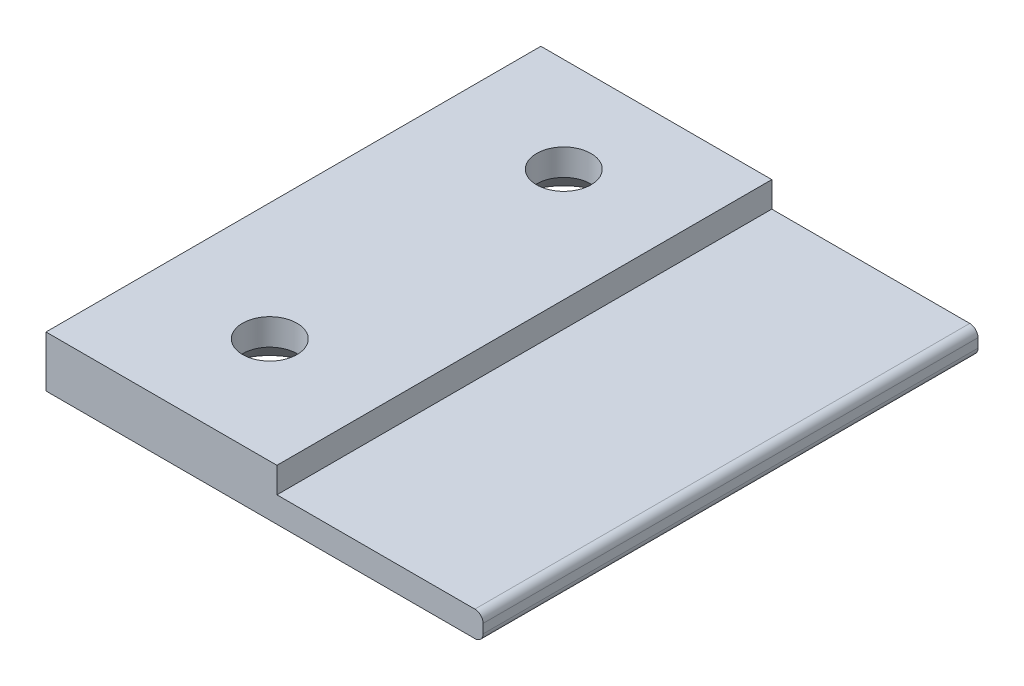
ISO-10303-21;
HEADER;
FILE_DESCRIPTION(('STEP AP214'),'2;1');
FILE_NAME('part.step','',(''),(''),'','','');
FILE_SCHEMA(('AUTOMOTIVE_DESIGN { 1 0 10303 214 1 1 1 1 }'));
ENDSEC;
DATA;
#1=APPLICATION_CONTEXT('core data for automotive mechanical design processes');
#2=APPLICATION_PROTOCOL_DEFINITION('international standard','automotive_design',2000,#1);
#3=PRODUCT_CONTEXT('',#1,'mechanical');
#4=PRODUCT('Part','Part','',(#3));
#5=PRODUCT_RELATED_PRODUCT_CATEGORY('part','',(#4));
#6=PRODUCT_DEFINITION_FORMATION('','',#4);
#7=PRODUCT_DEFINITION_CONTEXT('part definition',#1,'design');
#8=PRODUCT_DEFINITION('design','',#6,#7);
#9=PRODUCT_DEFINITION_SHAPE('','',#8);
#10=(LENGTH_UNIT() NAMED_UNIT(*) SI_UNIT(.MILLI.,.METRE.));
#11=(NAMED_UNIT(*) PLANE_ANGLE_UNIT() SI_UNIT($,.RADIAN.));
#12=(NAMED_UNIT(*) SI_UNIT($,.STERADIAN.) SOLID_ANGLE_UNIT());
#13=UNCERTAINTY_MEASURE_WITH_UNIT(LENGTH_MEASURE(1.E-05),#10,'distance_accuracy_value','');
#14=(GEOMETRIC_REPRESENTATION_CONTEXT(3) GLOBAL_UNCERTAINTY_ASSIGNED_CONTEXT((#13)) GLOBAL_UNIT_ASSIGNED_CONTEXT((#10,
#11,#12)) REPRESENTATION_CONTEXT('',''));
#15=CARTESIAN_POINT('',(0.,0.,0.));
#16=DIRECTION('',(0.,0.,1.));
#17=DIRECTION('',(1.,0.,0.));
#18=AXIS2_PLACEMENT_3D('',#15,#16,#17);
#19=CARTESIAN_POINT('',(0.,-6.2,60.));
#20=DIRECTION('',(1.,0.,0.));
#21=DIRECTION('',(0.,0.,-1.));
#22=AXIS2_PLACEMENT_3D('',#19,#20,#21);
#23=PLANE('',#22);
#24=DIRECTION('',(0.,-1.,0.));
#25=VECTOR('',#24,1.);
#26=CARTESIAN_POINT('',(0.,-6.2,0.));
#27=LINE('',#26,#25);
#28=CARTESIAN_POINT('',(0.,0.,0.));
#29=VERTEX_POINT('',#28);
#30=CARTESIAN_POINT('',(0.,-6.2,0.));
#31=VERTEX_POINT('',#30);
#32=EDGE_CURVE('E129',#29,#31,#27,.T.);
#33=ORIENTED_EDGE('',*,*,#32,.T.);
#34=DIRECTION('',(0.,0.,-1.));
#35=VECTOR('',#34,1.);
#36=CARTESIAN_POINT('',(0.,-6.2,60.));
#37=LINE('',#36,#35);
#38=CARTESIAN_POINT('',(0.,-6.2,60.));
#39=VERTEX_POINT('',#38);
#40=EDGE_CURVE('E110',#39,#31,#37,.T.);
#41=ORIENTED_EDGE('',*,*,#40,.F.);
#42=DIRECTION('',(0.,-1.,0.));
#43=VECTOR('',#42,1.);
#44=CARTESIAN_POINT('',(0.,-6.2,60.));
#45=LINE('',#44,#43);
#46=CARTESIAN_POINT('',(0.,0.,60.));
#47=VERTEX_POINT('',#46);
#48=EDGE_CURVE('E116',#47,#39,#45,.T.);
#49=ORIENTED_EDGE('',*,*,#48,.F.);
#50=DIRECTION('',(0.,0.,-1.));
#51=VECTOR('',#50,1.);
#52=CARTESIAN_POINT('',(0.,0.,60.));
#53=LINE('',#52,#51);
#54=EDGE_CURVE('E188',#47,#29,#53,.T.);
#55=ORIENTED_EDGE('',*,*,#54,.T.);
#56=EDGE_LOOP('',(#33,#41,#49,#55));
#57=FACE_BOUND('',#56,.T.);
#58=ADVANCED_FACE('F39',(#57),#23,.F.);
#59=CARTESIAN_POINT('',(53.,-6.2,60.));
#60=DIRECTION('',(0.,1.,0.));
#61=DIRECTION('',(0.,0.,1.));
#62=AXIS2_PLACEMENT_3D('',#59,#60,#61);
#63=PLANE('',#62);
#64=CARTESIAN_POINT('',(14.293755615536,-6.2,11.5151442867863));
#65=DIRECTION('',(0.,-1.,0.));
#66=DIRECTION('',(0.,0.,-1.));
#67=AXIS2_PLACEMENT_3D('',#64,#65,#66);
#68=CIRCLE('',#67,6.3);
#69=CARTESIAN_POINT('',(14.293755615536,-6.2,5.21514428678633));
#70=VERTEX_POINT('',#69);
#71=EDGE_CURVE('E279',#70,#70,#68,.T.);
#72=ORIENTED_EDGE('',*,*,#71,.F.);
#73=EDGE_LOOP('',(#72));
#74=FACE_BOUND('',#73,.T.);
#75=CARTESIAN_POINT('',(14.293755615536,-6.2,47.1589377928567));
#76=DIRECTION('',(0.,-1.,0.));
#77=DIRECTION('',(0.,0.,-1.));
#78=AXIS2_PLACEMENT_3D('',#75,#76,#77);
#79=CIRCLE('',#78,6.3);
#80=CARTESIAN_POINT('',(14.293755615536,-6.2,40.8589377928567));
#81=VERTEX_POINT('',#80);
#82=EDGE_CURVE('E170',#81,#81,#79,.T.);
#83=ORIENTED_EDGE('',*,*,#82,.F.);
#84=EDGE_LOOP('',(#83));
#85=FACE_BOUND('',#84,.T.);
#86=DIRECTION('',(1.,0.,0.));
#87=VECTOR('',#86,1.);
#88=CARTESIAN_POINT('',(53.,-6.2,0.));
#89=LINE('',#88,#87);
#90=CARTESIAN_POINT('',(52.,-6.2,0.));
#91=VERTEX_POINT('',#90);
#92=EDGE_CURVE('E167',#31,#91,#89,.T.);
#93=ORIENTED_EDGE('',*,*,#92,.T.);
#94=DIRECTION('',(0.,0.,-1.));
#95=VECTOR('',#94,1.);
#96=CARTESIAN_POINT('',(52.,-6.2,60.));
#97=LINE('',#96,#95);
#98=CARTESIAN_POINT('',(52.,-6.2,60.));
#99=VERTEX_POINT('',#98);
#100=EDGE_CURVE('E11',#91,#99,#97,.F.);
#101=ORIENTED_EDGE('',*,*,#100,.T.);
#102=DIRECTION('',(1.,0.,0.));
#103=VECTOR('',#102,1.);
#104=CARTESIAN_POINT('',(53.,-6.2,60.));
#105=LINE('',#104,#103);
#106=EDGE_CURVE('E106',#39,#99,#105,.T.);
#107=ORIENTED_EDGE('',*,*,#106,.F.);
#108=ORIENTED_EDGE('',*,*,#40,.T.);
#109=EDGE_LOOP('',(#93,#101,#107,#108));
#110=FACE_BOUND('',#109,.T.);
#111=ADVANCED_FACE('F108',(#74,#85,#110),#63,.F.);
#112=CARTESIAN_POINT('',(53.,-3.1,60.));
#113=DIRECTION('',(-1.,0.,0.));
#114=DIRECTION('',(0.,0.,1.));
#115=AXIS2_PLACEMENT_3D('',#112,#113,#114);
#116=PLANE('',#115);
#117=DIRECTION('',(0.,1.,0.));
#118=VECTOR('',#117,1.);
#119=CARTESIAN_POINT('',(53.,-3.1,0.));
#120=LINE('',#119,#118);
#121=CARTESIAN_POINT('',(53.,-5.2,0.));
#122=VERTEX_POINT('',#121);
#123=CARTESIAN_POINT('',(53.,-4.1,0.));
#124=VERTEX_POINT('',#123);
#125=EDGE_CURVE('E192',#122,#124,#120,.T.);
#126=ORIENTED_EDGE('',*,*,#125,.T.);
#127=DIRECTION('',(0.,0.,-1.));
#128=VECTOR('',#127,1.);
#129=CARTESIAN_POINT('',(53.,-4.1,60.));
#130=LINE('',#129,#128);
#131=CARTESIAN_POINT('',(53.,-4.1,60.));
#132=VERTEX_POINT('',#131);
#133=EDGE_CURVE('E63',#124,#132,#130,.F.);
#134=ORIENTED_EDGE('',*,*,#133,.T.);
#135=DIRECTION('',(0.,1.,0.));
#136=VECTOR('',#135,1.);
#137=CARTESIAN_POINT('',(53.,-3.1,60.));
#138=LINE('',#137,#136);
#139=CARTESIAN_POINT('',(53.,-5.2,60.));
#140=VERTEX_POINT('',#139);
#141=EDGE_CURVE('E115',#140,#132,#138,.T.);
#142=ORIENTED_EDGE('',*,*,#141,.F.);
#143=DIRECTION('',(0.,0.,-1.));
#144=VECTOR('',#143,1.);
#145=CARTESIAN_POINT('',(53.,-5.2,60.));
#146=LINE('',#145,#144);
#147=EDGE_CURVE('E149',#140,#122,#146,.T.);
#148=ORIENTED_EDGE('',*,*,#147,.T.);
#149=EDGE_LOOP('',(#126,#134,#142,#148));
#150=FACE_BOUND('',#149,.T.);
#151=ADVANCED_FACE('F220',(#150),#116,.F.);
#152=CARTESIAN_POINT('',(28.,-3.1,60.));
#153=DIRECTION('',(0.,-1.,0.));
#154=DIRECTION('',(0.,0.,-1.));
#155=AXIS2_PLACEMENT_3D('',#152,#153,#154);
#156=PLANE('',#155);
#157=DIRECTION('',(-1.,0.,0.));
#158=VECTOR('',#157,1.);
#159=CARTESIAN_POINT('',(28.,-3.1,60.));
#160=LINE('',#159,#158);
#161=CARTESIAN_POINT('',(52.,-3.1,60.));
#162=VERTEX_POINT('',#161);
#163=CARTESIAN_POINT('',(28.,-3.1,60.));
#164=VERTEX_POINT('',#163);
#165=EDGE_CURVE('E181',#162,#164,#160,.T.);
#166=ORIENTED_EDGE('',*,*,#165,.F.);
#167=DIRECTION('',(0.,0.,-1.));
#168=VECTOR('',#167,1.);
#169=CARTESIAN_POINT('',(52.,-3.1,60.));
#170=LINE('',#169,#168);
#171=CARTESIAN_POINT('',(52.,-3.1,0.));
#172=VERTEX_POINT('',#171);
#173=EDGE_CURVE('E131',#162,#172,#170,.T.);
#174=ORIENTED_EDGE('',*,*,#173,.T.);
#175=DIRECTION('',(-1.,0.,0.));
#176=VECTOR('',#175,1.);
#177=CARTESIAN_POINT('',(28.,-3.1,0.));
#178=LINE('',#177,#176);
#179=CARTESIAN_POINT('',(28.,-3.1,0.));
#180=VERTEX_POINT('',#179);
#181=EDGE_CURVE('E195',#172,#180,#178,.T.);
#182=ORIENTED_EDGE('',*,*,#181,.T.);
#183=DIRECTION('',(0.,0.,-1.));
#184=VECTOR('',#183,1.);
#185=CARTESIAN_POINT('',(28.,-3.1,60.));
#186=LINE('',#185,#184);
#187=EDGE_CURVE('E132',#164,#180,#186,.T.);
#188=ORIENTED_EDGE('',*,*,#187,.F.);
#189=EDGE_LOOP('',(#166,#174,#182,#188));
#190=FACE_BOUND('',#189,.T.);
#191=ADVANCED_FACE('F226',(#190),#156,.F.);
#192=CARTESIAN_POINT('',(28.,0.,60.));
#193=DIRECTION('',(-1.,0.,0.));
#194=DIRECTION('',(0.,0.,1.));
#195=AXIS2_PLACEMENT_3D('',#192,#193,#194);
#196=PLANE('',#195);
#197=DIRECTION('',(0.,1.,0.));
#198=VECTOR('',#197,1.);
#199=CARTESIAN_POINT('',(28.,0.,0.));
#200=LINE('',#199,#198);
#201=CARTESIAN_POINT('',(28.,0.,0.));
#202=VERTEX_POINT('',#201);
#203=EDGE_CURVE('E198',#180,#202,#200,.T.);
#204=ORIENTED_EDGE('',*,*,#203,.T.);
#205=DIRECTION('',(0.,0.,-1.));
#206=VECTOR('',#205,1.);
#207=CARTESIAN_POINT('',(28.,0.,60.));
#208=LINE('',#207,#206);
#209=CARTESIAN_POINT('',(28.,0.,60.));
#210=VERTEX_POINT('',#209);
#211=EDGE_CURVE('E140',#210,#202,#208,.T.);
#212=ORIENTED_EDGE('',*,*,#211,.F.);
#213=DIRECTION('',(0.,1.,0.));
#214=VECTOR('',#213,1.);
#215=CARTESIAN_POINT('',(28.,0.,60.));
#216=LINE('',#215,#214);
#217=EDGE_CURVE('E184',#164,#210,#216,.T.);
#218=ORIENTED_EDGE('',*,*,#217,.F.);
#219=ORIENTED_EDGE('',*,*,#187,.T.);
#220=EDGE_LOOP('',(#204,#212,#218,#219));
#221=FACE_BOUND('',#220,.T.);
#222=ADVANCED_FACE('F228',(#221),#196,.F.);
#223=CARTESIAN_POINT('',(0.,0.,60.));
#224=DIRECTION('',(0.,-1.,0.));
#225=DIRECTION('',(0.,0.,-1.));
#226=AXIS2_PLACEMENT_3D('',#223,#224,#225);
#227=PLANE('',#226);
#228=CARTESIAN_POINT('',(14.293755615536,0.,11.5151442867863));
#229=DIRECTION('',(0.,-1.,0.));
#230=DIRECTION('',(0.,0.,-1.));
#231=AXIS2_PLACEMENT_3D('',#228,#229,#230);
#232=CIRCLE('',#231,3.3);
#233=CARTESIAN_POINT('',(14.293755615536,0.,8.21514428678634));
#234=VERTEX_POINT('',#233);
#235=EDGE_CURVE('E43',#234,#234,#232,.T.);
#236=ORIENTED_EDGE('',*,*,#235,.T.);
#237=EDGE_LOOP('',(#236));
#238=FACE_BOUND('',#237,.T.);
#239=CARTESIAN_POINT('',(14.293755615536,0.,47.1589377928567));
#240=DIRECTION('',(0.,-1.,0.));
#241=DIRECTION('',(0.,0.,-1.));
#242=AXIS2_PLACEMENT_3D('',#239,#240,#241);
#243=CIRCLE('',#242,3.3);
#244=CARTESIAN_POINT('',(14.293755615536,0.,43.8589377928567));
#245=VERTEX_POINT('',#244);
#246=EDGE_CURVE('E159',#245,#245,#243,.T.);
#247=ORIENTED_EDGE('',*,*,#246,.T.);
#248=EDGE_LOOP('',(#247));
#249=FACE_BOUND('',#248,.T.);
#250=DIRECTION('',(-1.,0.,0.));
#251=VECTOR('',#250,1.);
#252=CARTESIAN_POINT('',(0.,0.,0.));
#253=LINE('',#252,#251);
#254=EDGE_CURVE('E126',#202,#29,#253,.T.);
#255=ORIENTED_EDGE('',*,*,#254,.T.);
#256=ORIENTED_EDGE('',*,*,#54,.F.);
#257=DIRECTION('',(-1.,0.,0.));
#258=VECTOR('',#257,1.);
#259=CARTESIAN_POINT('',(0.,0.,60.));
#260=LINE('',#259,#258);
#261=EDGE_CURVE('E121',#210,#47,#260,.T.);
#262=ORIENTED_EDGE('',*,*,#261,.F.);
#263=ORIENTED_EDGE('',*,*,#211,.T.);
#264=EDGE_LOOP('',(#255,#256,#262,#263));
#265=FACE_BOUND('',#264,.T.);
#266=ADVANCED_FACE('F209',(#238,#249,#265),#227,.F.);
#267=CARTESIAN_POINT('',(0.,0.,60.));
#268=DIRECTION('',(0.,0.,-1.));
#269=DIRECTION('',(-1.,0.,0.));
#270=AXIS2_PLACEMENT_3D('',#267,#268,#269);
#271=PLANE('',#270);
#272=ORIENTED_EDGE('',*,*,#141,.T.);
#273=CARTESIAN_POINT('',(52.,-4.1,60.));
#274=DIRECTION('',(0.,0.,-1.));
#275=DIRECTION('',(-1.,0.,0.));
#276=AXIS2_PLACEMENT_3D('',#273,#274,#275);
#277=CIRCLE('',#276,1.);
#278=EDGE_CURVE('E49',#132,#162,#277,.F.);
#279=ORIENTED_EDGE('',*,*,#278,.T.);
#280=ORIENTED_EDGE('',*,*,#165,.T.);
#281=ORIENTED_EDGE('',*,*,#217,.T.);
#282=ORIENTED_EDGE('',*,*,#261,.T.);
#283=ORIENTED_EDGE('',*,*,#48,.T.);
#284=ORIENTED_EDGE('',*,*,#106,.T.);
#285=CARTESIAN_POINT('',(52.,-5.2,60.));
#286=DIRECTION('',(0.,0.,-1.));
#287=DIRECTION('',(-1.,0.,0.));
#288=AXIS2_PLACEMENT_3D('',#285,#286,#287);
#289=CIRCLE('',#288,1.);
#290=EDGE_CURVE('E155',#99,#140,#289,.F.);
#291=ORIENTED_EDGE('',*,*,#290,.T.);
#292=EDGE_LOOP('',(#272,#279,#280,#281,#282,#283,#284,#291));
#293=FACE_BOUND('',#292,.T.);
#294=ADVANCED_FACE('F119',(#293),#271,.F.);
#295=CARTESIAN_POINT('',(0.,0.,0.));
#296=DIRECTION('',(0.,0.,-1.));
#297=DIRECTION('',(-1.,0.,0.));
#298=AXIS2_PLACEMENT_3D('',#295,#296,#297);
#299=PLANE('',#298);
#300=ORIENTED_EDGE('',*,*,#181,.F.);
#301=CARTESIAN_POINT('',(52.,-4.1,0.));
#302=DIRECTION('',(0.,0.,-1.));
#303=DIRECTION('',(-1.,0.,0.));
#304=AXIS2_PLACEMENT_3D('',#301,#302,#303);
#305=CIRCLE('',#304,1.);
#306=EDGE_CURVE('E146',#172,#124,#305,.T.);
#307=ORIENTED_EDGE('',*,*,#306,.T.);
#308=ORIENTED_EDGE('',*,*,#125,.F.);
#309=CARTESIAN_POINT('',(52.,-5.2,0.));
#310=DIRECTION('',(0.,0.,-1.));
#311=DIRECTION('',(-1.,0.,0.));
#312=AXIS2_PLACEMENT_3D('',#309,#310,#311);
#313=CIRCLE('',#312,1.);
#314=EDGE_CURVE('E137',#122,#91,#313,.T.);
#315=ORIENTED_EDGE('',*,*,#314,.T.);
#316=ORIENTED_EDGE('',*,*,#92,.F.);
#317=ORIENTED_EDGE('',*,*,#32,.F.);
#318=ORIENTED_EDGE('',*,*,#254,.F.);
#319=ORIENTED_EDGE('',*,*,#203,.F.);
#320=EDGE_LOOP('',(#300,#307,#308,#315,#316,#317,#318,#319));
#321=FACE_BOUND('',#320,.T.);
#322=ADVANCED_FACE('F215',(#321),#299,.T.);
#323=CARTESIAN_POINT('',(52.,-4.1,60.));
#324=DIRECTION('',(0.,0.,-1.));
#325=DIRECTION('',(-1.,0.,0.));
#326=AXIS2_PLACEMENT_3D('',#323,#324,#325);
#327=CYLINDRICAL_SURFACE('',#326,1.);
#328=ORIENTED_EDGE('',*,*,#278,.F.);
#329=ORIENTED_EDGE('',*,*,#133,.F.);
#330=ORIENTED_EDGE('',*,*,#306,.F.);
#331=ORIENTED_EDGE('',*,*,#173,.F.);
#332=EDGE_LOOP('',(#328,#329,#330,#331));
#333=FACE_BOUND('',#332,.T.);
#334=ADVANCED_FACE('F223',(#333),#327,.T.);
#335=CARTESIAN_POINT('',(52.,-5.2,60.));
#336=DIRECTION('',(0.,0.,-1.));
#337=DIRECTION('',(-1.,0.,0.));
#338=AXIS2_PLACEMENT_3D('',#335,#336,#337);
#339=CYLINDRICAL_SURFACE('',#338,1.);
#340=ORIENTED_EDGE('',*,*,#290,.F.);
#341=ORIENTED_EDGE('',*,*,#100,.F.);
#342=ORIENTED_EDGE('',*,*,#314,.F.);
#343=ORIENTED_EDGE('',*,*,#147,.F.);
#344=EDGE_LOOP('',(#340,#341,#342,#343));
#345=FACE_BOUND('',#344,.T.);
#346=ADVANCED_FACE('F41',(#345),#339,.T.);
#347=CARTESIAN_POINT('',(14.293755615536,-6.2,47.1589377928567));
#348=DIRECTION('',(0.,-1.,0.));
#349=DIRECTION('',(0.,0.,-1.));
#350=AXIS2_PLACEMENT_3D('',#347,#348,#349);
#351=CYLINDRICAL_SURFACE('',#350,3.3);
#352=CARTESIAN_POINT('',(14.293755615536,-3.2,47.1589377928567));
#353=DIRECTION('',(0.,-1.,0.));
#354=DIRECTION('',(0.,0.,-1.));
#355=AXIS2_PLACEMENT_3D('',#352,#353,#354);
#356=CIRCLE('',#355,3.29999999999999);
#357=CARTESIAN_POINT('',(14.293755615536,-3.2,43.8589377928567));
#358=VERTEX_POINT('',#357);
#359=EDGE_CURVE('E162',#358,#358,#356,.T.);
#360=ORIENTED_EDGE('',*,*,#359,.T.);
#361=EDGE_LOOP('',(#360));
#362=FACE_BOUND('',#361,.T.);
#363=ORIENTED_EDGE('',*,*,#246,.F.);
#364=EDGE_LOOP('',(#363));
#365=FACE_BOUND('',#364,.T.);
#366=ADVANCED_FACE('F251',(#362,#365),#351,.F.);
#367=CARTESIAN_POINT('',(14.293755615536,-6.2,47.1589377928567));
#368=DIRECTION('',(0.,-1.,0.));
#369=DIRECTION('',(0.,0.,-1.));
#370=AXIS2_PLACEMENT_3D('',#367,#368,#369);
#371=CONICAL_SURFACE('',#370,6.3,0.785398163397449);
#372=ORIENTED_EDGE('',*,*,#359,.F.);
#373=EDGE_LOOP('',(#372));
#374=FACE_BOUND('',#373,.T.);
#375=ORIENTED_EDGE('',*,*,#82,.T.);
#376=EDGE_LOOP('',(#375));
#377=FACE_BOUND('',#376,.T.);
#378=ADVANCED_FACE('F260',(#374,#377),#371,.F.);
#379=CARTESIAN_POINT('',(14.293755615536,-6.2,11.5151442867863));
#380=DIRECTION('',(0.,-1.,0.));
#381=DIRECTION('',(0.,0.,-1.));
#382=AXIS2_PLACEMENT_3D('',#379,#380,#381);
#383=CYLINDRICAL_SURFACE('',#382,3.3);
#384=CARTESIAN_POINT('',(14.293755615536,-3.2,11.5151442867863));
#385=DIRECTION('',(0.,-1.,0.));
#386=DIRECTION('',(0.,0.,-1.));
#387=AXIS2_PLACEMENT_3D('',#384,#385,#386);
#388=CIRCLE('',#387,3.29999999999999);
#389=CARTESIAN_POINT('',(14.293755615536,-3.2,8.21514428678634));
#390=VERTEX_POINT('',#389);
#391=EDGE_CURVE('E276',#390,#390,#388,.T.);
#392=ORIENTED_EDGE('',*,*,#391,.T.);
#393=EDGE_LOOP('',(#392));
#394=FACE_BOUND('',#393,.T.);
#395=ORIENTED_EDGE('',*,*,#235,.F.);
#396=EDGE_LOOP('',(#395));
#397=FACE_BOUND('',#396,.T.);
#398=ADVANCED_FACE('F263',(#394,#397),#383,.F.);
#399=CARTESIAN_POINT('',(14.293755615536,-6.2,11.5151442867863));
#400=DIRECTION('',(0.,-1.,0.));
#401=DIRECTION('',(0.,0.,-1.));
#402=AXIS2_PLACEMENT_3D('',#399,#400,#401);
#403=CONICAL_SURFACE('',#402,6.3,0.785398163397449);
#404=ORIENTED_EDGE('',*,*,#391,.F.);
#405=EDGE_LOOP('',(#404));
#406=FACE_BOUND('',#405,.T.);
#407=ORIENTED_EDGE('',*,*,#71,.T.);
#408=EDGE_LOOP('',(#407));
#409=FACE_BOUND('',#408,.T.);
#410=ADVANCED_FACE('F267',(#406,#409),#403,.F.);
#411=CLOSED_SHELL('',(#58,#111,#151,#191,#222,#266,#294,#322,#334,#346,#366,#378,#398,#410));
#412=MANIFOLD_SOLID_BREP('B2',#411);
#413=ADVANCED_BREP_SHAPE_REPRESENTATION('',(#18,#412),#14);
#414=SHAPE_DEFINITION_REPRESENTATION(#9,#413);
ENDSEC;
END-ISO-10303-21;
